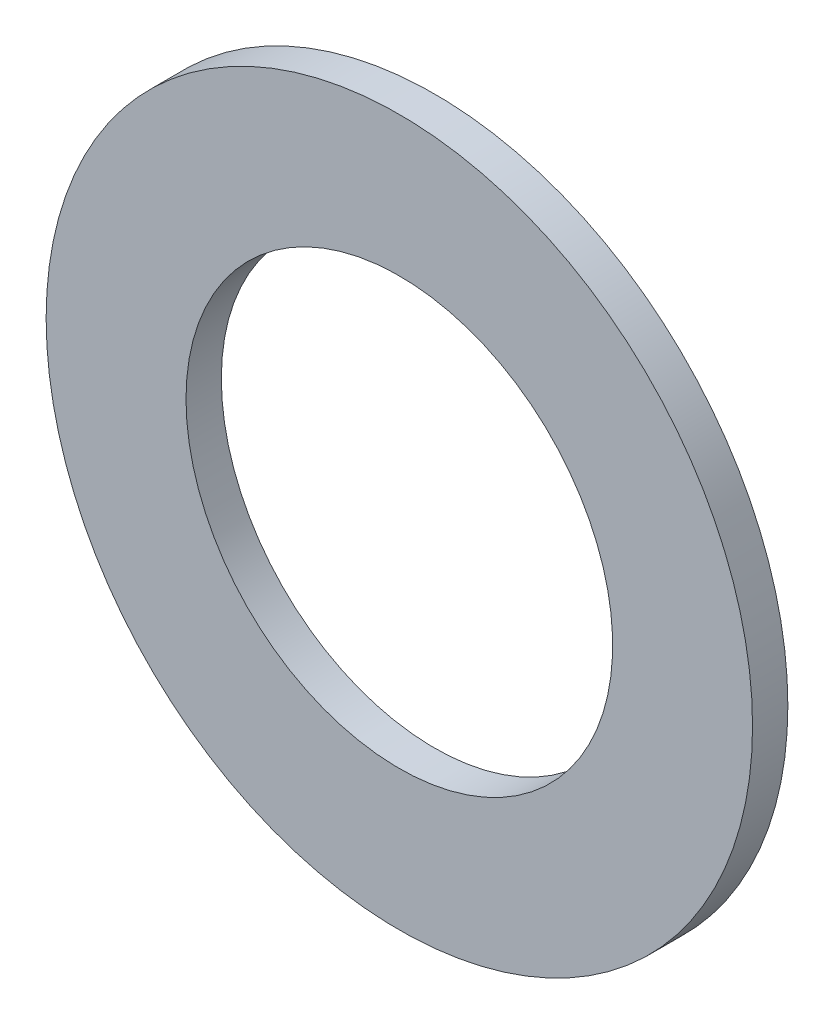
ISO-10303-21;
HEADER;
FILE_DESCRIPTION(('STEP AP214'),'2;1');
FILE_NAME('part.step','',(''),(''),'','','');
FILE_SCHEMA(('AUTOMOTIVE_DESIGN { 1 0 10303 214 1 1 1 1 }'));
ENDSEC;
DATA;
#1=APPLICATION_CONTEXT('core data for automotive mechanical design processes');
#2=APPLICATION_PROTOCOL_DEFINITION('international standard','automotive_design',2000,#1);
#3=PRODUCT_CONTEXT('',#1,'mechanical');
#4=PRODUCT('Part','Part','',(#3));
#5=PRODUCT_RELATED_PRODUCT_CATEGORY('part','',(#4));
#6=PRODUCT_DEFINITION_FORMATION('','',#4);
#7=PRODUCT_DEFINITION_CONTEXT('part definition',#1,'design');
#8=PRODUCT_DEFINITION('design','',#6,#7);
#9=PRODUCT_DEFINITION_SHAPE('','',#8);
#10=(LENGTH_UNIT() NAMED_UNIT(*) SI_UNIT(.MILLI.,.METRE.));
#11=(NAMED_UNIT(*) PLANE_ANGLE_UNIT() SI_UNIT($,.RADIAN.));
#12=(NAMED_UNIT(*) SI_UNIT($,.STERADIAN.) SOLID_ANGLE_UNIT());
#13=UNCERTAINTY_MEASURE_WITH_UNIT(LENGTH_MEASURE(1.E-05),#10,'distance_accuracy_value','');
#14=(GEOMETRIC_REPRESENTATION_CONTEXT(3) GLOBAL_UNCERTAINTY_ASSIGNED_CONTEXT((#13)) GLOBAL_UNIT_ASSIGNED_CONTEXT((#10,
#11,#12)) REPRESENTATION_CONTEXT('',''));
#15=CARTESIAN_POINT('',(0.,0.,0.));
#16=DIRECTION('',(0.,0.,1.));
#17=DIRECTION('',(1.,0.,0.));
#18=AXIS2_PLACEMENT_3D('',#15,#16,#17);
#19=CARTESIAN_POINT('',(0.,0.,-0.79375));
#20=DIRECTION('',(0.,0.,1.));
#21=DIRECTION('',(1.,0.,0.));
#22=AXIS2_PLACEMENT_3D('',#19,#20,#21);
#23=PLANE('',#22);
#24=CARTESIAN_POINT('',(0.,0.,-0.79375));
#25=DIRECTION('',(0.,0.,-1.));
#26=DIRECTION('',(-1.,0.,0.));
#27=AXIS2_PLACEMENT_3D('',#24,#25,#26);
#28=CIRCLE('',#27,9.5885);
#29=CARTESIAN_POINT('',(-9.5885,0.,-0.79375));
#30=VERTEX_POINT('',#29);
#31=EDGE_CURVE('E28',#30,#30,#28,.F.);
#32=ORIENTED_EDGE('',*,*,#31,.T.);
#33=EDGE_LOOP('',(#32));
#34=FACE_BOUND('',#33,.T.);
#35=CARTESIAN_POINT('',(0.,0.,-0.79375));
#36=DIRECTION('',(0.,0.,-1.));
#37=DIRECTION('',(-1.,0.,0.));
#38=AXIS2_PLACEMENT_3D('',#35,#36,#37);
#39=CIRCLE('',#38,15.875);
#40=CARTESIAN_POINT('',(-15.875,0.,-0.79375));
#41=VERTEX_POINT('',#40);
#42=EDGE_CURVE('E19',#41,#41,#39,.F.);
#43=ORIENTED_EDGE('',*,*,#42,.F.);
#44=EDGE_LOOP('',(#43));
#45=FACE_BOUND('',#44,.T.);
#46=ADVANCED_FACE('F16',(#34,#45),#23,.F.);
#47=CARTESIAN_POINT('',(0.,0.,0.79375));
#48=DIRECTION('',(0.,0.,-1.));
#49=DIRECTION('',(-1.,0.,0.));
#50=AXIS2_PLACEMENT_3D('',#47,#48,#49);
#51=CYLINDRICAL_SURFACE('',#50,15.875);
#52=ORIENTED_EDGE('',*,*,#42,.T.);
#53=EDGE_LOOP('',(#52));
#54=FACE_BOUND('',#53,.T.);
#55=CARTESIAN_POINT('',(0.,0.,0.79375));
#56=DIRECTION('',(0.,0.,-1.));
#57=DIRECTION('',(-1.,0.,0.));
#58=AXIS2_PLACEMENT_3D('',#55,#56,#57);
#59=CIRCLE('',#58,15.875);
#60=CARTESIAN_POINT('',(-15.875,0.,0.79375));
#61=VERTEX_POINT('',#60);
#62=EDGE_CURVE('E23',#61,#61,#59,.F.);
#63=ORIENTED_EDGE('',*,*,#62,.F.);
#64=EDGE_LOOP('',(#63));
#65=FACE_BOUND('',#64,.T.);
#66=ADVANCED_FACE('F36',(#54,#65),#51,.T.);
#67=CARTESIAN_POINT('',(0.,0.,0.79375));
#68=DIRECTION('',(0.,0.,-1.));
#69=DIRECTION('',(-1.,0.,0.));
#70=AXIS2_PLACEMENT_3D('',#67,#68,#69);
#71=CYLINDRICAL_SURFACE('',#70,9.5885);
#72=CARTESIAN_POINT('',(0.,0.,0.79375));
#73=DIRECTION('',(0.,0.,-1.));
#74=DIRECTION('',(-1.,0.,0.));
#75=AXIS2_PLACEMENT_3D('',#72,#73,#74);
#76=CIRCLE('',#75,9.5885);
#77=CARTESIAN_POINT('',(-9.5885,0.,0.79375));
#78=VERTEX_POINT('',#77);
#79=EDGE_CURVE('E10',#78,#78,#76,.T.);
#80=ORIENTED_EDGE('',*,*,#79,.F.);
#81=EDGE_LOOP('',(#80));
#82=FACE_BOUND('',#81,.T.);
#83=ORIENTED_EDGE('',*,*,#31,.F.);
#84=EDGE_LOOP('',(#83));
#85=FACE_BOUND('',#84,.T.);
#86=ADVANCED_FACE('F43',(#82,#85),#71,.F.);
#87=CARTESIAN_POINT('',(0.,0.,0.79375));
#88=DIRECTION('',(0.,0.,1.));
#89=DIRECTION('',(1.,0.,0.));
#90=AXIS2_PLACEMENT_3D('',#87,#88,#89);
#91=PLANE('',#90);
#92=ORIENTED_EDGE('',*,*,#79,.T.);
#93=EDGE_LOOP('',(#92));
#94=FACE_BOUND('',#93,.T.);
#95=ORIENTED_EDGE('',*,*,#62,.T.);
#96=EDGE_LOOP('',(#95));
#97=FACE_BOUND('',#96,.T.);
#98=ADVANCED_FACE('F44',(#94,#97),#91,.T.);
#99=CLOSED_SHELL('',(#46,#66,#86,#98));
#100=MANIFOLD_SOLID_BREP('B1',#99);
#101=ADVANCED_BREP_SHAPE_REPRESENTATION('',(#18,#100),#14);
#102=SHAPE_DEFINITION_REPRESENTATION(#9,#101);
ENDSEC;
END-ISO-10303-21;
